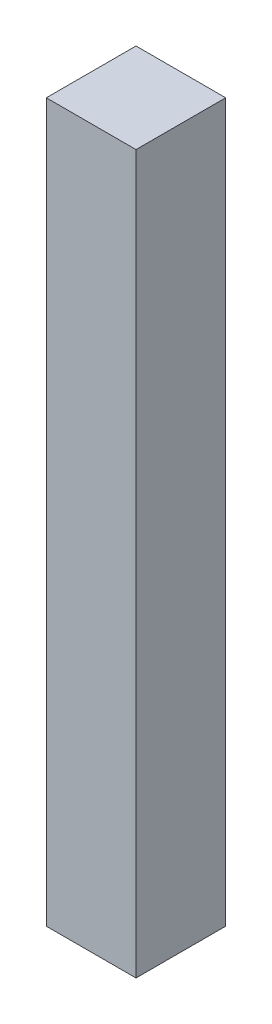
ISO-10303-21;
HEADER;
FILE_DESCRIPTION(('STEP AP214'),'2;1');
FILE_NAME('part.step','',(''),(''),'','','');
FILE_SCHEMA(('AUTOMOTIVE_DESIGN { 1 0 10303 214 1 1 1 1 }'));
ENDSEC;
DATA;
#1=APPLICATION_CONTEXT('core data for automotive mechanical design processes');
#2=APPLICATION_PROTOCOL_DEFINITION('international standard','automotive_design',2000,#1);
#3=PRODUCT_CONTEXT('',#1,'mechanical');
#4=PRODUCT('Part','Part','',(#3));
#5=PRODUCT_RELATED_PRODUCT_CATEGORY('part','',(#4));
#6=PRODUCT_DEFINITION_FORMATION('','',#4);
#7=PRODUCT_DEFINITION_CONTEXT('part definition',#1,'design');
#8=PRODUCT_DEFINITION('design','',#6,#7);
#9=PRODUCT_DEFINITION_SHAPE('','',#8);
#10=(LENGTH_UNIT() NAMED_UNIT(*) SI_UNIT(.MILLI.,.METRE.));
#11=(NAMED_UNIT(*) PLANE_ANGLE_UNIT() SI_UNIT($,.RADIAN.));
#12=(NAMED_UNIT(*) SI_UNIT($,.STERADIAN.) SOLID_ANGLE_UNIT());
#13=UNCERTAINTY_MEASURE_WITH_UNIT(LENGTH_MEASURE(1.E-05),#10,'distance_accuracy_value','');
#14=(GEOMETRIC_REPRESENTATION_CONTEXT(3) GLOBAL_UNCERTAINTY_ASSIGNED_CONTEXT((#13)) GLOBAL_UNIT_ASSIGNED_CONTEXT((#10,
#11,#12)) REPRESENTATION_CONTEXT('',''));
#15=CARTESIAN_POINT('',(0.,0.,0.));
#16=DIRECTION('',(0.,0.,1.));
#17=DIRECTION('',(1.,0.,0.));
#18=AXIS2_PLACEMENT_3D('',#15,#16,#17);
#19=CARTESIAN_POINT('',(1.5875,-12.7,3.175));
#20=DIRECTION('',(-1.,0.,0.));
#21=DIRECTION('',(0.,0.,1.));
#22=AXIS2_PLACEMENT_3D('',#19,#20,#21);
#23=PLANE('',#22);
#24=DIRECTION('',(0.,1.,0.));
#25=VECTOR('',#24,1.);
#26=CARTESIAN_POINT('',(1.5875,-12.7,0.));
#27=LINE('',#26,#25);
#28=CARTESIAN_POINT('',(1.5875,-12.7,0.));
#29=VERTEX_POINT('',#28);
#30=CARTESIAN_POINT('',(1.5875,12.7,0.));
#31=VERTEX_POINT('',#30);
#32=EDGE_CURVE('E111',#29,#31,#27,.T.);
#33=ORIENTED_EDGE('',*,*,#32,.T.);
#34=DIRECTION('',(0.,0.,-1.));
#35=VECTOR('',#34,1.);
#36=CARTESIAN_POINT('',(1.5875,12.7,3.175));
#37=LINE('',#36,#35);
#38=CARTESIAN_POINT('',(1.5875,12.7,3.175));
#39=VERTEX_POINT('',#38);
#40=EDGE_CURVE('E11',#39,#31,#37,.T.);
#41=ORIENTED_EDGE('',*,*,#40,.F.);
#42=DIRECTION('',(0.,1.,0.));
#43=VECTOR('',#42,1.);
#44=CARTESIAN_POINT('',(1.5875,-12.7,3.175));
#45=LINE('',#44,#43);
#46=CARTESIAN_POINT('',(1.5875,-12.7,3.175));
#47=VERTEX_POINT('',#46);
#48=EDGE_CURVE('E95',#47,#39,#45,.T.);
#49=ORIENTED_EDGE('',*,*,#48,.F.);
#50=DIRECTION('',(0.,0.,-1.));
#51=VECTOR('',#50,1.);
#52=CARTESIAN_POINT('',(1.5875,-12.7,3.175));
#53=LINE('',#52,#51);
#54=EDGE_CURVE('E107',#47,#29,#53,.T.);
#55=ORIENTED_EDGE('',*,*,#54,.T.);
#56=EDGE_LOOP('',(#33,#41,#49,#55));
#57=FACE_BOUND('',#56,.T.);
#58=ADVANCED_FACE('F43',(#57),#23,.F.);
#59=CARTESIAN_POINT('',(-1.5875,12.7,3.175));
#60=DIRECTION('',(0.,-1.,0.));
#61=DIRECTION('',(0.,0.,-1.));
#62=AXIS2_PLACEMENT_3D('',#59,#60,#61);
#63=PLANE('',#62);
#64=DIRECTION('',(-1.,0.,0.));
#65=VECTOR('',#64,1.);
#66=CARTESIAN_POINT('',(-1.5875,12.7,0.));
#67=LINE('',#66,#65);
#68=CARTESIAN_POINT('',(-1.5875,12.7,0.));
#69=VERTEX_POINT('',#68);
#70=EDGE_CURVE('E100',#31,#69,#67,.T.);
#71=ORIENTED_EDGE('',*,*,#70,.T.);
#72=DIRECTION('',(0.,0.,-1.));
#73=VECTOR('',#72,1.);
#74=CARTESIAN_POINT('',(-1.5875,12.7,3.175));
#75=LINE('',#74,#73);
#76=CARTESIAN_POINT('',(-1.5875,12.7,3.175));
#77=VERTEX_POINT('',#76);
#78=EDGE_CURVE('E52',#77,#69,#75,.T.);
#79=ORIENTED_EDGE('',*,*,#78,.F.);
#80=DIRECTION('',(-1.,0.,0.));
#81=VECTOR('',#80,1.);
#82=CARTESIAN_POINT('',(-1.5875,12.7,3.175));
#83=LINE('',#82,#81);
#84=EDGE_CURVE('E90',#39,#77,#83,.T.);
#85=ORIENTED_EDGE('',*,*,#84,.F.);
#86=ORIENTED_EDGE('',*,*,#40,.T.);
#87=EDGE_LOOP('',(#71,#79,#85,#86));
#88=FACE_BOUND('',#87,.T.);
#89=ADVANCED_FACE('F99',(#88),#63,.F.);
#90=CARTESIAN_POINT('',(-1.5875,-12.7,3.175));
#91=DIRECTION('',(1.,0.,0.));
#92=DIRECTION('',(0.,0.,-1.));
#93=AXIS2_PLACEMENT_3D('',#90,#91,#92);
#94=PLANE('',#93);
#95=DIRECTION('',(0.,-1.,0.));
#96=VECTOR('',#95,1.);
#97=CARTESIAN_POINT('',(-1.5875,-12.7,0.));
#98=LINE('',#97,#96);
#99=CARTESIAN_POINT('',(-1.5875,-12.7,0.));
#100=VERTEX_POINT('',#99);
#101=EDGE_CURVE('E77',#69,#100,#98,.T.);
#102=ORIENTED_EDGE('',*,*,#101,.T.);
#103=DIRECTION('',(0.,0.,-1.));
#104=VECTOR('',#103,1.);
#105=CARTESIAN_POINT('',(-1.5875,-12.7,3.175));
#106=LINE('',#105,#104);
#107=CARTESIAN_POINT('',(-1.5875,-12.7,3.175));
#108=VERTEX_POINT('',#107);
#109=EDGE_CURVE('E102',#108,#100,#106,.T.);
#110=ORIENTED_EDGE('',*,*,#109,.F.);
#111=DIRECTION('',(0.,-1.,0.));
#112=VECTOR('',#111,1.);
#113=CARTESIAN_POINT('',(-1.5875,-12.7,3.175));
#114=LINE('',#113,#112);
#115=EDGE_CURVE('E93',#77,#108,#114,.T.);
#116=ORIENTED_EDGE('',*,*,#115,.F.);
#117=ORIENTED_EDGE('',*,*,#78,.T.);
#118=EDGE_LOOP('',(#102,#110,#116,#117));
#119=FACE_BOUND('',#118,.T.);
#120=ADVANCED_FACE('F103',(#119),#94,.F.);
#121=CARTESIAN_POINT('',(-1.5875,-12.7,3.175));
#122=DIRECTION('',(0.,1.,0.));
#123=DIRECTION('',(0.,0.,1.));
#124=AXIS2_PLACEMENT_3D('',#121,#122,#123);
#125=PLANE('',#124);
#126=DIRECTION('',(1.,0.,0.));
#127=VECTOR('',#126,1.);
#128=CARTESIAN_POINT('',(-1.5875,-12.7,0.));
#129=LINE('',#128,#127);
#130=EDGE_CURVE('E83',#100,#29,#129,.T.);
#131=ORIENTED_EDGE('',*,*,#130,.T.);
#132=ORIENTED_EDGE('',*,*,#54,.F.);
#133=DIRECTION('',(1.,0.,0.));
#134=VECTOR('',#133,1.);
#135=CARTESIAN_POINT('',(-1.5875,-12.7,3.175));
#136=LINE('',#135,#134);
#137=EDGE_CURVE('E60',#108,#47,#136,.T.);
#138=ORIENTED_EDGE('',*,*,#137,.F.);
#139=ORIENTED_EDGE('',*,*,#109,.T.);
#140=EDGE_LOOP('',(#131,#132,#138,#139));
#141=FACE_BOUND('',#140,.T.);
#142=ADVANCED_FACE('F124',(#141),#125,.F.);
#143=CARTESIAN_POINT('',(0.,0.,3.175));
#144=DIRECTION('',(0.,0.,-1.));
#145=DIRECTION('',(-1.,0.,0.));
#146=AXIS2_PLACEMENT_3D('',#143,#144,#145);
#147=PLANE('',#146);
#148=ORIENTED_EDGE('',*,*,#48,.T.);
#149=ORIENTED_EDGE('',*,*,#84,.T.);
#150=ORIENTED_EDGE('',*,*,#115,.T.);
#151=ORIENTED_EDGE('',*,*,#137,.T.);
#152=EDGE_LOOP('',(#148,#149,#150,#151));
#153=FACE_BOUND('',#152,.T.);
#154=ADVANCED_FACE('F91',(#153),#147,.F.);
#155=CARTESIAN_POINT('',(0.,0.,0.));
#156=DIRECTION('',(0.,0.,-1.));
#157=DIRECTION('',(-1.,0.,0.));
#158=AXIS2_PLACEMENT_3D('',#155,#156,#157);
#159=PLANE('',#158);
#160=ORIENTED_EDGE('',*,*,#32,.F.);
#161=ORIENTED_EDGE('',*,*,#130,.F.);
#162=ORIENTED_EDGE('',*,*,#101,.F.);
#163=ORIENTED_EDGE('',*,*,#70,.F.);
#164=EDGE_LOOP('',(#160,#161,#162,#163));
#165=FACE_BOUND('',#164,.T.);
#166=ADVANCED_FACE('F127',(#165),#159,.T.);
#167=CLOSED_SHELL('',(#58,#89,#120,#142,#154,#166));
#168=MANIFOLD_SOLID_BREP('B2',#167);
#169=ADVANCED_BREP_SHAPE_REPRESENTATION('',(#18,#168),#14);
#170=SHAPE_DEFINITION_REPRESENTATION(#9,#169);
ENDSEC;
END-ISO-10303-21;
